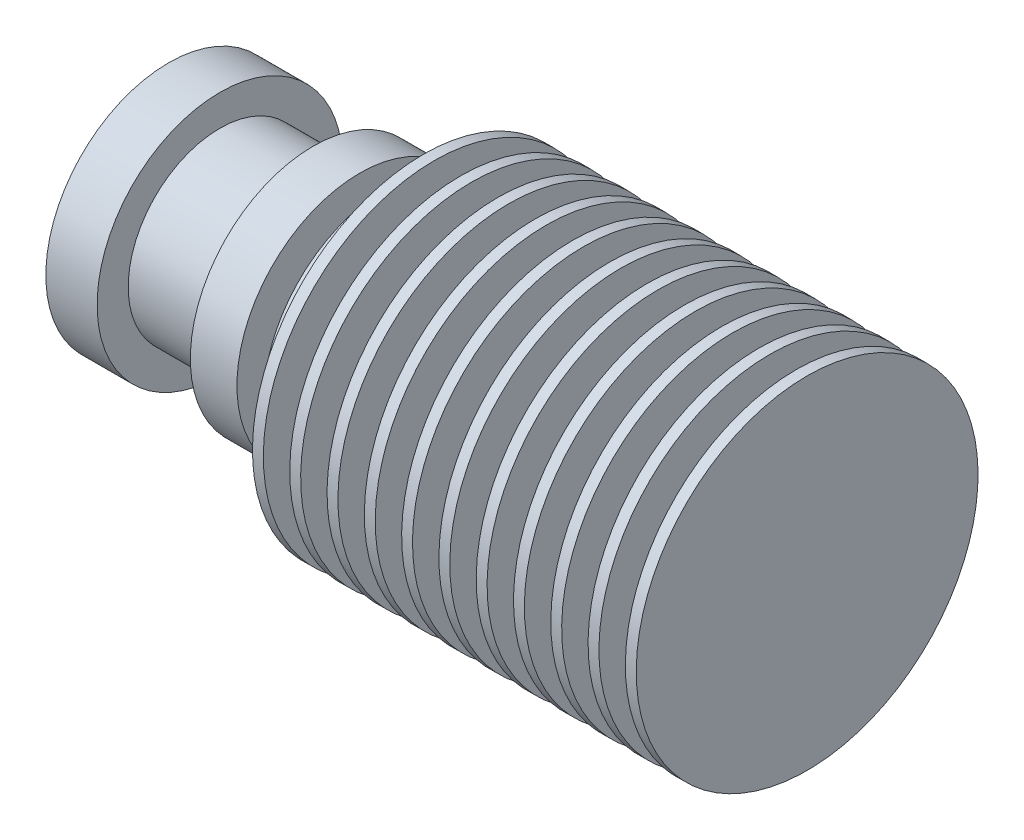
ISO-10303-21;
HEADER;
FILE_DESCRIPTION(('STEP AP214'),'2;1');
FILE_NAME('part.step','',(''),(''),'','','');
FILE_SCHEMA(('AUTOMOTIVE_DESIGN { 1 0 10303 214 1 1 1 1 }'));
ENDSEC;
DATA;
#1=APPLICATION_CONTEXT('core data for automotive mechanical design processes');
#2=APPLICATION_PROTOCOL_DEFINITION('international standard','automotive_design',2000,#1);
#3=PRODUCT_CONTEXT('',#1,'mechanical');
#4=PRODUCT('Part','Part','',(#3));
#5=PRODUCT_RELATED_PRODUCT_CATEGORY('part','',(#4));
#6=PRODUCT_DEFINITION_FORMATION('','',#4);
#7=PRODUCT_DEFINITION_CONTEXT('part definition',#1,'design');
#8=PRODUCT_DEFINITION('design','',#6,#7);
#9=PRODUCT_DEFINITION_SHAPE('','',#8);
#10=(LENGTH_UNIT() NAMED_UNIT(*) SI_UNIT(.MILLI.,.METRE.));
#11=(NAMED_UNIT(*) PLANE_ANGLE_UNIT() SI_UNIT($,.RADIAN.));
#12=(NAMED_UNIT(*) SI_UNIT($,.STERADIAN.) SOLID_ANGLE_UNIT());
#13=UNCERTAINTY_MEASURE_WITH_UNIT(LENGTH_MEASURE(1.E-05),#10,'distance_accuracy_value','');
#14=(GEOMETRIC_REPRESENTATION_CONTEXT(3) GLOBAL_UNCERTAINTY_ASSIGNED_CONTEXT((#13)) GLOBAL_UNIT_ASSIGNED_CONTEXT((#10,
#11,#12)) REPRESENTATION_CONTEXT('',''));
#15=CARTESIAN_POINT('',(0.,0.,0.));
#16=DIRECTION('',(0.,0.,1.));
#17=DIRECTION('',(1.,0.,0.));
#18=AXIS2_PLACEMENT_3D('',#15,#16,#17);
#19=CARTESIAN_POINT('',(-27.999975,5.,0.));
#20=DIRECTION('',(1.,0.,0.));
#21=DIRECTION('',(0.,1.,0.));
#22=AXIS2_PLACEMENT_3D('',#19,#20,#21);
#23=PLANE('',#22);
#24=CARTESIAN_POINT('',(-27.999975,5.,0.));
#25=DIRECTION('',(1.,0.,0.));
#26=DIRECTION('',(0.,1.,0.));
#27=AXIS2_PLACEMENT_3D('',#24,#25,#26);
#28=CIRCLE('',#27,11.);
#29=CARTESIAN_POINT('',(-27.999975,16.,0.));
#30=VERTEX_POINT('',#29);
#31=EDGE_CURVE('E10',#30,#30,#28,.T.);
#32=ORIENTED_EDGE('',*,*,#31,.T.);
#33=EDGE_LOOP('',(#32));
#34=FACE_BOUND('',#33,.T.);
#35=ADVANCED_FACE('F30',(#34),#23,.T.);
#36=CARTESIAN_POINT('',(-27.999975,5.,0.));
#37=DIRECTION('',(1.,0.,0.));
#38=DIRECTION('',(0.,1.,0.));
#39=AXIS2_PLACEMENT_3D('',#36,#37,#38);
#40=CYLINDRICAL_SURFACE('',#39,11.);
#41=CARTESIAN_POINT('',(-28.699975,5.,0.));
#42=DIRECTION('',(1.,0.,0.));
#43=DIRECTION('',(0.,1.,0.));
#44=AXIS2_PLACEMENT_3D('',#41,#42,#43);
#45=CIRCLE('',#44,11.);
#46=CARTESIAN_POINT('',(-28.699975,16.,0.));
#47=VERTEX_POINT('',#46);
#48=EDGE_CURVE('E36',#47,#47,#45,.T.);
#49=ORIENTED_EDGE('',*,*,#48,.T.);
#50=EDGE_LOOP('',(#49));
#51=FACE_BOUND('',#50,.T.);
#52=ORIENTED_EDGE('',*,*,#31,.F.);
#53=EDGE_LOOP('',(#52));
#54=FACE_BOUND('',#53,.T.);
#55=ADVANCED_FACE('F212',(#51,#54),#40,.T.);
#56=CARTESIAN_POINT('',(-28.699975,16.,0.));
#57=DIRECTION('',(-1.,0.,0.));
#58=DIRECTION('',(0.,-1.,0.));
#59=AXIS2_PLACEMENT_3D('',#56,#57,#58);
#60=PLANE('',#59);
#61=CARTESIAN_POINT('',(-28.699975,5.,0.));
#62=DIRECTION('',(1.,0.,0.));
#63=DIRECTION('',(0.,1.,0.));
#64=AXIS2_PLACEMENT_3D('',#61,#62,#63);
#65=CIRCLE('',#64,5.);
#66=CARTESIAN_POINT('',(-28.699975,10.,0.));
#67=VERTEX_POINT('',#66);
#68=EDGE_CURVE('E40',#67,#67,#65,.T.);
#69=ORIENTED_EDGE('',*,*,#68,.T.);
#70=EDGE_LOOP('',(#69));
#71=FACE_BOUND('',#70,.T.);
#72=ORIENTED_EDGE('',*,*,#48,.F.);
#73=EDGE_LOOP('',(#72));
#74=FACE_BOUND('',#73,.T.);
#75=ADVANCED_FACE('F216',(#71,#74),#60,.T.);
#76=CARTESIAN_POINT('',(-27.999975,5.,0.));
#77=DIRECTION('',(1.,0.,0.));
#78=DIRECTION('',(0.,1.,0.));
#79=AXIS2_PLACEMENT_3D('',#76,#77,#78);
#80=CYLINDRICAL_SURFACE('',#79,5.);
#81=CARTESIAN_POINT('',(-30.399975,5.,0.));
#82=DIRECTION('',(1.,0.,0.));
#83=DIRECTION('',(0.,1.,0.));
#84=AXIS2_PLACEMENT_3D('',#81,#82,#83);
#85=CIRCLE('',#84,5.);
#86=CARTESIAN_POINT('',(-30.399975,10.,0.));
#87=VERTEX_POINT('',#86);
#88=EDGE_CURVE('E44',#87,#87,#85,.T.);
#89=ORIENTED_EDGE('',*,*,#88,.T.);
#90=EDGE_LOOP('',(#89));
#91=FACE_BOUND('',#90,.T.);
#92=ORIENTED_EDGE('',*,*,#68,.F.);
#93=EDGE_LOOP('',(#92));
#94=FACE_BOUND('',#93,.T.);
#95=ADVANCED_FACE('F220',(#91,#94),#80,.T.);
#96=CARTESIAN_POINT('',(-30.399975,10.,0.));
#97=DIRECTION('',(1.,0.,0.));
#98=DIRECTION('',(0.,1.,0.));
#99=AXIS2_PLACEMENT_3D('',#96,#97,#98);
#100=PLANE('',#99);
#101=CARTESIAN_POINT('',(-30.399975,5.,0.));
#102=DIRECTION('',(1.,0.,0.));
#103=DIRECTION('',(0.,1.,0.));
#104=AXIS2_PLACEMENT_3D('',#101,#102,#103);
#105=CIRCLE('',#104,11.);
#106=CARTESIAN_POINT('',(-30.399975,16.,0.));
#107=VERTEX_POINT('',#106);
#108=EDGE_CURVE('E49',#107,#107,#105,.T.);
#109=ORIENTED_EDGE('',*,*,#108,.T.);
#110=EDGE_LOOP('',(#109));
#111=FACE_BOUND('',#110,.T.);
#112=ORIENTED_EDGE('',*,*,#88,.F.);
#113=EDGE_LOOP('',(#112));
#114=FACE_BOUND('',#113,.T.);
#115=ADVANCED_FACE('F227',(#111,#114),#100,.T.);
#116=CARTESIAN_POINT('',(-27.999975,5.,0.));
#117=DIRECTION('',(1.,0.,0.));
#118=DIRECTION('',(0.,1.,0.));
#119=AXIS2_PLACEMENT_3D('',#116,#117,#118);
#120=CYLINDRICAL_SURFACE('',#119,11.);
#121=CARTESIAN_POINT('',(-31.099975,5.,0.));
#122=DIRECTION('',(1.,0.,0.));
#123=DIRECTION('',(0.,1.,0.));
#124=AXIS2_PLACEMENT_3D('',#121,#122,#123);
#125=CIRCLE('',#124,11.);
#126=CARTESIAN_POINT('',(-31.099975,16.,0.));
#127=VERTEX_POINT('',#126);
#128=EDGE_CURVE('E52',#127,#127,#125,.T.);
#129=ORIENTED_EDGE('',*,*,#128,.T.);
#130=EDGE_LOOP('',(#129));
#131=FACE_BOUND('',#130,.T.);
#132=ORIENTED_EDGE('',*,*,#108,.F.);
#133=EDGE_LOOP('',(#132));
#134=FACE_BOUND('',#133,.T.);
#135=ADVANCED_FACE('F231',(#131,#134),#120,.T.);
#136=CARTESIAN_POINT('',(-31.099975,16.,0.));
#137=DIRECTION('',(-1.,0.,0.));
#138=DIRECTION('',(0.,-1.,0.));
#139=AXIS2_PLACEMENT_3D('',#136,#137,#138);
#140=PLANE('',#139);
#141=CARTESIAN_POINT('',(-31.099975,5.,0.));
#142=DIRECTION('',(1.,0.,0.));
#143=DIRECTION('',(0.,1.,0.));
#144=AXIS2_PLACEMENT_3D('',#141,#142,#143);
#145=CIRCLE('',#144,4.99999999999998);
#146=CARTESIAN_POINT('',(-31.099975,9.99999999999998,0.));
#147=VERTEX_POINT('',#146);
#148=EDGE_CURVE('E55',#147,#147,#145,.T.);
#149=ORIENTED_EDGE('',*,*,#148,.T.);
#150=EDGE_LOOP('',(#149));
#151=FACE_BOUND('',#150,.T.);
#152=ORIENTED_EDGE('',*,*,#128,.F.);
#153=EDGE_LOOP('',(#152));
#154=FACE_BOUND('',#153,.T.);
#155=ADVANCED_FACE('F235',(#151,#154),#140,.T.);
#156=CARTESIAN_POINT('',(-27.999975,5.,0.));
#157=DIRECTION('',(1.,0.,0.));
#158=DIRECTION('',(0.,1.,0.));
#159=AXIS2_PLACEMENT_3D('',#156,#157,#158);
#160=CYLINDRICAL_SURFACE('',#159,4.99999999999998);
#161=CARTESIAN_POINT('',(-32.799975,5.,0.));
#162=DIRECTION('',(1.,0.,0.));
#163=DIRECTION('',(0.,1.,0.));
#164=AXIS2_PLACEMENT_3D('',#161,#162,#163);
#165=CIRCLE('',#164,4.99999999999999);
#166=CARTESIAN_POINT('',(-32.799975,9.99999999999998,0.));
#167=VERTEX_POINT('',#166);
#168=EDGE_CURVE('E58',#167,#167,#165,.T.);
#169=ORIENTED_EDGE('',*,*,#168,.T.);
#170=EDGE_LOOP('',(#169));
#171=FACE_BOUND('',#170,.T.);
#172=ORIENTED_EDGE('',*,*,#148,.F.);
#173=EDGE_LOOP('',(#172));
#174=FACE_BOUND('',#173,.T.);
#175=ADVANCED_FACE('F239',(#171,#174),#160,.T.);
#176=CARTESIAN_POINT('',(-32.799975,9.99999999999998,0.));
#177=DIRECTION('',(1.,0.,0.));
#178=DIRECTION('',(0.,1.,0.));
#179=AXIS2_PLACEMENT_3D('',#176,#177,#178);
#180=PLANE('',#179);
#181=CARTESIAN_POINT('',(-32.799975,5.,0.));
#182=DIRECTION('',(1.,0.,0.));
#183=DIRECTION('',(0.,1.,0.));
#184=AXIS2_PLACEMENT_3D('',#181,#182,#183);
#185=CIRCLE('',#184,11.);
#186=CARTESIAN_POINT('',(-32.799975,16.,0.));
#187=VERTEX_POINT('',#186);
#188=EDGE_CURVE('E61',#187,#187,#185,.T.);
#189=ORIENTED_EDGE('',*,*,#188,.T.);
#190=EDGE_LOOP('',(#189));
#191=FACE_BOUND('',#190,.T.);
#192=ORIENTED_EDGE('',*,*,#168,.F.);
#193=EDGE_LOOP('',(#192));
#194=FACE_BOUND('',#193,.T.);
#195=ADVANCED_FACE('F243',(#191,#194),#180,.T.);
#196=CARTESIAN_POINT('',(-27.999975,5.,0.));
#197=DIRECTION('',(1.,0.,0.));
#198=DIRECTION('',(0.,1.,0.));
#199=AXIS2_PLACEMENT_3D('',#196,#197,#198);
#200=CYLINDRICAL_SURFACE('',#199,11.);
#201=CARTESIAN_POINT('',(-33.499975,5.,0.));
#202=DIRECTION('',(1.,0.,0.));
#203=DIRECTION('',(0.,1.,0.));
#204=AXIS2_PLACEMENT_3D('',#201,#202,#203);
#205=CIRCLE('',#204,11.);
#206=CARTESIAN_POINT('',(-33.499975,16.,0.));
#207=VERTEX_POINT('',#206);
#208=EDGE_CURVE('E64',#207,#207,#205,.T.);
#209=ORIENTED_EDGE('',*,*,#208,.T.);
#210=EDGE_LOOP('',(#209));
#211=FACE_BOUND('',#210,.T.);
#212=ORIENTED_EDGE('',*,*,#188,.F.);
#213=EDGE_LOOP('',(#212));
#214=FACE_BOUND('',#213,.T.);
#215=ADVANCED_FACE('F247',(#211,#214),#200,.T.);
#216=CARTESIAN_POINT('',(-33.499975,16.,0.));
#217=DIRECTION('',(-1.,0.,0.));
#218=DIRECTION('',(0.,-1.,0.));
#219=AXIS2_PLACEMENT_3D('',#216,#217,#218);
#220=PLANE('',#219);
#221=CARTESIAN_POINT('',(-33.499975,5.,0.));
#222=DIRECTION('',(1.,0.,0.));
#223=DIRECTION('',(0.,1.,0.));
#224=AXIS2_PLACEMENT_3D('',#221,#222,#223);
#225=CIRCLE('',#224,4.99999999999997);
#226=CARTESIAN_POINT('',(-33.499975,9.99999999999997,0.));
#227=VERTEX_POINT('',#226);
#228=EDGE_CURVE('E67',#227,#227,#225,.T.);
#229=ORIENTED_EDGE('',*,*,#228,.T.);
#230=EDGE_LOOP('',(#229));
#231=FACE_BOUND('',#230,.T.);
#232=ORIENTED_EDGE('',*,*,#208,.F.);
#233=EDGE_LOOP('',(#232));
#234=FACE_BOUND('',#233,.T.);
#235=ADVANCED_FACE('F251',(#231,#234),#220,.T.);
#236=CARTESIAN_POINT('',(-27.999975,5.,0.));
#237=DIRECTION('',(1.,0.,0.));
#238=DIRECTION('',(0.,1.,0.));
#239=AXIS2_PLACEMENT_3D('',#236,#237,#238);
#240=CYLINDRICAL_SURFACE('',#239,4.99999999999997);
#241=CARTESIAN_POINT('',(-35.199975,5.,0.));
#242=DIRECTION('',(1.,0.,0.));
#243=DIRECTION('',(0.,1.,0.));
#244=AXIS2_PLACEMENT_3D('',#241,#242,#243);
#245=CIRCLE('',#244,4.99999999999997);
#246=CARTESIAN_POINT('',(-35.199975,9.99999999999997,0.));
#247=VERTEX_POINT('',#246);
#248=EDGE_CURVE('E70',#247,#247,#245,.T.);
#249=ORIENTED_EDGE('',*,*,#248,.T.);
#250=EDGE_LOOP('',(#249));
#251=FACE_BOUND('',#250,.T.);
#252=ORIENTED_EDGE('',*,*,#228,.F.);
#253=EDGE_LOOP('',(#252));
#254=FACE_BOUND('',#253,.T.);
#255=ADVANCED_FACE('F255',(#251,#254),#240,.T.);
#256=CARTESIAN_POINT('',(-35.199975,9.99999999999997,0.));
#257=DIRECTION('',(1.,0.,0.));
#258=DIRECTION('',(0.,1.,0.));
#259=AXIS2_PLACEMENT_3D('',#256,#257,#258);
#260=PLANE('',#259);
#261=CARTESIAN_POINT('',(-35.199975,5.,0.));
#262=DIRECTION('',(1.,0.,0.));
#263=DIRECTION('',(0.,1.,0.));
#264=AXIS2_PLACEMENT_3D('',#261,#262,#263);
#265=CIRCLE('',#264,11.);
#266=CARTESIAN_POINT('',(-35.199975,16.,0.));
#267=VERTEX_POINT('',#266);
#268=EDGE_CURVE('E73',#267,#267,#265,.T.);
#269=ORIENTED_EDGE('',*,*,#268,.T.);
#270=EDGE_LOOP('',(#269));
#271=FACE_BOUND('',#270,.T.);
#272=ORIENTED_EDGE('',*,*,#248,.F.);
#273=EDGE_LOOP('',(#272));
#274=FACE_BOUND('',#273,.T.);
#275=ADVANCED_FACE('F259',(#271,#274),#260,.T.);
#276=CARTESIAN_POINT('',(-27.999975,5.,0.));
#277=DIRECTION('',(1.,0.,0.));
#278=DIRECTION('',(0.,1.,0.));
#279=AXIS2_PLACEMENT_3D('',#276,#277,#278);
#280=CYLINDRICAL_SURFACE('',#279,11.);
#281=CARTESIAN_POINT('',(-35.899975,5.,0.));
#282=DIRECTION('',(1.,0.,0.));
#283=DIRECTION('',(0.,1.,0.));
#284=AXIS2_PLACEMENT_3D('',#281,#282,#283);
#285=CIRCLE('',#284,11.);
#286=CARTESIAN_POINT('',(-35.899975,16.,0.));
#287=VERTEX_POINT('',#286);
#288=EDGE_CURVE('E76',#287,#287,#285,.T.);
#289=ORIENTED_EDGE('',*,*,#288,.T.);
#290=EDGE_LOOP('',(#289));
#291=FACE_BOUND('',#290,.T.);
#292=ORIENTED_EDGE('',*,*,#268,.F.);
#293=EDGE_LOOP('',(#292));
#294=FACE_BOUND('',#293,.T.);
#295=ADVANCED_FACE('F263',(#291,#294),#280,.T.);
#296=CARTESIAN_POINT('',(-35.899975,16.,0.));
#297=DIRECTION('',(-1.,0.,0.));
#298=DIRECTION('',(0.,-1.,0.));
#299=AXIS2_PLACEMENT_3D('',#296,#297,#298);
#300=PLANE('',#299);
#301=CARTESIAN_POINT('',(-35.899975,5.,0.));
#302=DIRECTION('',(1.,0.,0.));
#303=DIRECTION('',(0.,1.,0.));
#304=AXIS2_PLACEMENT_3D('',#301,#302,#303);
#305=CIRCLE('',#304,4.99999999999995);
#306=CARTESIAN_POINT('',(-35.899975,9.99999999999995,0.));
#307=VERTEX_POINT('',#306);
#308=EDGE_CURVE('E79',#307,#307,#305,.T.);
#309=ORIENTED_EDGE('',*,*,#308,.T.);
#310=EDGE_LOOP('',(#309));
#311=FACE_BOUND('',#310,.T.);
#312=ORIENTED_EDGE('',*,*,#288,.F.);
#313=EDGE_LOOP('',(#312));
#314=FACE_BOUND('',#313,.T.);
#315=ADVANCED_FACE('F267',(#311,#314),#300,.T.);
#316=CARTESIAN_POINT('',(-27.999975,5.,0.));
#317=DIRECTION('',(1.,0.,0.));
#318=DIRECTION('',(0.,1.,0.));
#319=AXIS2_PLACEMENT_3D('',#316,#317,#318);
#320=CYLINDRICAL_SURFACE('',#319,4.99999999999995);
#321=CARTESIAN_POINT('',(-37.599975,5.,0.));
#322=DIRECTION('',(1.,0.,0.));
#323=DIRECTION('',(0.,1.,0.));
#324=AXIS2_PLACEMENT_3D('',#321,#322,#323);
#325=CIRCLE('',#324,4.99999999999995);
#326=CARTESIAN_POINT('',(-37.599975,9.99999999999995,0.));
#327=VERTEX_POINT('',#326);
#328=EDGE_CURVE('E82',#327,#327,#325,.T.);
#329=ORIENTED_EDGE('',*,*,#328,.T.);
#330=EDGE_LOOP('',(#329));
#331=FACE_BOUND('',#330,.T.);
#332=ORIENTED_EDGE('',*,*,#308,.F.);
#333=EDGE_LOOP('',(#332));
#334=FACE_BOUND('',#333,.T.);
#335=ADVANCED_FACE('F271',(#331,#334),#320,.T.);
#336=CARTESIAN_POINT('',(-37.599975,9.99999999999995,0.));
#337=DIRECTION('',(1.,0.,0.));
#338=DIRECTION('',(0.,1.,0.));
#339=AXIS2_PLACEMENT_3D('',#336,#337,#338);
#340=PLANE('',#339);
#341=CARTESIAN_POINT('',(-37.599975,5.,0.));
#342=DIRECTION('',(1.,0.,0.));
#343=DIRECTION('',(0.,1.,0.));
#344=AXIS2_PLACEMENT_3D('',#341,#342,#343);
#345=CIRCLE('',#344,10.9999999999999);
#346=CARTESIAN_POINT('',(-37.599975,15.9999999999999,0.));
#347=VERTEX_POINT('',#346);
#348=EDGE_CURVE('E85',#347,#347,#345,.T.);
#349=ORIENTED_EDGE('',*,*,#348,.T.);
#350=EDGE_LOOP('',(#349));
#351=FACE_BOUND('',#350,.T.);
#352=ORIENTED_EDGE('',*,*,#328,.F.);
#353=EDGE_LOOP('',(#352));
#354=FACE_BOUND('',#353,.T.);
#355=ADVANCED_FACE('F275',(#351,#354),#340,.T.);
#356=CARTESIAN_POINT('',(-27.999975,5.,0.));
#357=DIRECTION('',(1.,0.,0.));
#358=DIRECTION('',(0.,1.,0.));
#359=AXIS2_PLACEMENT_3D('',#356,#357,#358);
#360=CYLINDRICAL_SURFACE('',#359,10.9999999999999);
#361=CARTESIAN_POINT('',(-38.299975,5.,0.));
#362=DIRECTION('',(1.,0.,0.));
#363=DIRECTION('',(0.,1.,0.));
#364=AXIS2_PLACEMENT_3D('',#361,#362,#363);
#365=CIRCLE('',#364,10.9999999999999);
#366=CARTESIAN_POINT('',(-38.299975,15.9999999999999,0.));
#367=VERTEX_POINT('',#366);
#368=EDGE_CURVE('E88',#367,#367,#365,.T.);
#369=ORIENTED_EDGE('',*,*,#368,.T.);
#370=EDGE_LOOP('',(#369));
#371=FACE_BOUND('',#370,.T.);
#372=ORIENTED_EDGE('',*,*,#348,.F.);
#373=EDGE_LOOP('',(#372));
#374=FACE_BOUND('',#373,.T.);
#375=ADVANCED_FACE('F279',(#371,#374),#360,.T.);
#376=CARTESIAN_POINT('',(-38.299975,15.9999999999999,0.));
#377=DIRECTION('',(-1.,0.,0.));
#378=DIRECTION('',(0.,-1.,0.));
#379=AXIS2_PLACEMENT_3D('',#376,#377,#378);
#380=PLANE('',#379);
#381=CARTESIAN_POINT('',(-38.299975,5.,0.));
#382=DIRECTION('',(1.,0.,0.));
#383=DIRECTION('',(0.,1.,0.));
#384=AXIS2_PLACEMENT_3D('',#381,#382,#383);
#385=CIRCLE('',#384,4.99999999999993);
#386=CARTESIAN_POINT('',(-38.299975,9.99999999999993,0.));
#387=VERTEX_POINT('',#386);
#388=EDGE_CURVE('E91',#387,#387,#385,.T.);
#389=ORIENTED_EDGE('',*,*,#388,.T.);
#390=EDGE_LOOP('',(#389));
#391=FACE_BOUND('',#390,.T.);
#392=ORIENTED_EDGE('',*,*,#368,.F.);
#393=EDGE_LOOP('',(#392));
#394=FACE_BOUND('',#393,.T.);
#395=ADVANCED_FACE('F283',(#391,#394),#380,.T.);
#396=CARTESIAN_POINT('',(-27.999975,5.,0.));
#397=DIRECTION('',(1.,0.,0.));
#398=DIRECTION('',(0.,1.,0.));
#399=AXIS2_PLACEMENT_3D('',#396,#397,#398);
#400=CYLINDRICAL_SURFACE('',#399,4.99999999999994);
#401=CARTESIAN_POINT('',(-39.999975,5.,0.));
#402=DIRECTION('',(1.,0.,0.));
#403=DIRECTION('',(0.,1.,0.));
#404=AXIS2_PLACEMENT_3D('',#401,#402,#403);
#405=CIRCLE('',#404,4.99999999999994);
#406=CARTESIAN_POINT('',(-39.999975,9.99999999999993,0.));
#407=VERTEX_POINT('',#406);
#408=EDGE_CURVE('E94',#407,#407,#405,.T.);
#409=ORIENTED_EDGE('',*,*,#408,.T.);
#410=EDGE_LOOP('',(#409));
#411=FACE_BOUND('',#410,.T.);
#412=ORIENTED_EDGE('',*,*,#388,.F.);
#413=EDGE_LOOP('',(#412));
#414=FACE_BOUND('',#413,.T.);
#415=ADVANCED_FACE('F287',(#411,#414),#400,.T.);
#416=CARTESIAN_POINT('',(-39.999975,9.99999999999993,0.));
#417=DIRECTION('',(1.,0.,0.));
#418=DIRECTION('',(0.,1.,0.));
#419=AXIS2_PLACEMENT_3D('',#416,#417,#418);
#420=PLANE('',#419);
#421=CARTESIAN_POINT('',(-39.999975,5.,0.));
#422=DIRECTION('',(1.,0.,0.));
#423=DIRECTION('',(0.,1.,0.));
#424=AXIS2_PLACEMENT_3D('',#421,#422,#423);
#425=CIRCLE('',#424,10.9999999999999);
#426=CARTESIAN_POINT('',(-39.999975,15.9999999999999,0.));
#427=VERTEX_POINT('',#426);
#428=EDGE_CURVE('E97',#427,#427,#425,.T.);
#429=ORIENTED_EDGE('',*,*,#428,.T.);
#430=EDGE_LOOP('',(#429));
#431=FACE_BOUND('',#430,.T.);
#432=ORIENTED_EDGE('',*,*,#408,.F.);
#433=EDGE_LOOP('',(#432));
#434=FACE_BOUND('',#433,.T.);
#435=ADVANCED_FACE('F291',(#431,#434),#420,.T.);
#436=CARTESIAN_POINT('',(-27.999975,5.,0.));
#437=DIRECTION('',(1.,0.,0.));
#438=DIRECTION('',(0.,1.,0.));
#439=AXIS2_PLACEMENT_3D('',#436,#437,#438);
#440=CYLINDRICAL_SURFACE('',#439,10.9999999999999);
#441=CARTESIAN_POINT('',(-40.699975,5.,0.));
#442=DIRECTION('',(1.,0.,0.));
#443=DIRECTION('',(0.,1.,0.));
#444=AXIS2_PLACEMENT_3D('',#441,#442,#443);
#445=CIRCLE('',#444,10.9999999999999);
#446=CARTESIAN_POINT('',(-40.699975,15.9999999999999,0.));
#447=VERTEX_POINT('',#446);
#448=EDGE_CURVE('E100',#447,#447,#445,.T.);
#449=ORIENTED_EDGE('',*,*,#448,.T.);
#450=EDGE_LOOP('',(#449));
#451=FACE_BOUND('',#450,.T.);
#452=ORIENTED_EDGE('',*,*,#428,.F.);
#453=EDGE_LOOP('',(#452));
#454=FACE_BOUND('',#453,.T.);
#455=ADVANCED_FACE('F295',(#451,#454),#440,.T.);
#456=CARTESIAN_POINT('',(-40.699975,15.9999999999999,0.));
#457=DIRECTION('',(-1.,0.,0.));
#458=DIRECTION('',(0.,-1.,0.));
#459=AXIS2_PLACEMENT_3D('',#456,#457,#458);
#460=PLANE('',#459);
#461=CARTESIAN_POINT('',(-40.699975,5.,0.));
#462=DIRECTION('',(1.,0.,0.));
#463=DIRECTION('',(0.,1.,0.));
#464=AXIS2_PLACEMENT_3D('',#461,#462,#463);
#465=CIRCLE('',#464,4.99999999999992);
#466=CARTESIAN_POINT('',(-40.699975,9.99999999999992,0.));
#467=VERTEX_POINT('',#466);
#468=EDGE_CURVE('E103',#467,#467,#465,.T.);
#469=ORIENTED_EDGE('',*,*,#468,.T.);
#470=EDGE_LOOP('',(#469));
#471=FACE_BOUND('',#470,.T.);
#472=ORIENTED_EDGE('',*,*,#448,.F.);
#473=EDGE_LOOP('',(#472));
#474=FACE_BOUND('',#473,.T.);
#475=ADVANCED_FACE('F299',(#471,#474),#460,.T.);
#476=CARTESIAN_POINT('',(-27.999975,5.,0.));
#477=DIRECTION('',(1.,0.,0.));
#478=DIRECTION('',(0.,1.,0.));
#479=AXIS2_PLACEMENT_3D('',#476,#477,#478);
#480=CYLINDRICAL_SURFACE('',#479,4.99999999999992);
#481=CARTESIAN_POINT('',(-42.399975,5.,0.));
#482=DIRECTION('',(1.,0.,0.));
#483=DIRECTION('',(0.,1.,0.));
#484=AXIS2_PLACEMENT_3D('',#481,#482,#483);
#485=CIRCLE('',#484,4.99999999999992);
#486=CARTESIAN_POINT('',(-42.399975,9.99999999999992,0.));
#487=VERTEX_POINT('',#486);
#488=EDGE_CURVE('E106',#487,#487,#485,.T.);
#489=ORIENTED_EDGE('',*,*,#488,.T.);
#490=EDGE_LOOP('',(#489));
#491=FACE_BOUND('',#490,.T.);
#492=ORIENTED_EDGE('',*,*,#468,.F.);
#493=EDGE_LOOP('',(#492));
#494=FACE_BOUND('',#493,.T.);
#495=ADVANCED_FACE('F303',(#491,#494),#480,.T.);
#496=CARTESIAN_POINT('',(-42.399975,9.99999999999992,0.));
#497=DIRECTION('',(1.,0.,0.));
#498=DIRECTION('',(0.,1.,0.));
#499=AXIS2_PLACEMENT_3D('',#496,#497,#498);
#500=PLANE('',#499);
#501=CARTESIAN_POINT('',(-42.399975,5.,0.));
#502=DIRECTION('',(1.,0.,0.));
#503=DIRECTION('',(0.,1.,0.));
#504=AXIS2_PLACEMENT_3D('',#501,#502,#503);
#505=CIRCLE('',#504,10.9999999999999);
#506=CARTESIAN_POINT('',(-42.399975,15.9999999999999,0.));
#507=VERTEX_POINT('',#506);
#508=EDGE_CURVE('E109',#507,#507,#505,.T.);
#509=ORIENTED_EDGE('',*,*,#508,.T.);
#510=EDGE_LOOP('',(#509));
#511=FACE_BOUND('',#510,.T.);
#512=ORIENTED_EDGE('',*,*,#488,.F.);
#513=EDGE_LOOP('',(#512));
#514=FACE_BOUND('',#513,.T.);
#515=ADVANCED_FACE('F307',(#511,#514),#500,.T.);
#516=CARTESIAN_POINT('',(-27.999975,5.,0.));
#517=DIRECTION('',(1.,0.,0.));
#518=DIRECTION('',(0.,1.,0.));
#519=AXIS2_PLACEMENT_3D('',#516,#517,#518);
#520=CYLINDRICAL_SURFACE('',#519,10.9999999999999);
#521=CARTESIAN_POINT('',(-43.099975,5.,0.));
#522=DIRECTION('',(1.,0.,0.));
#523=DIRECTION('',(0.,1.,0.));
#524=AXIS2_PLACEMENT_3D('',#521,#522,#523);
#525=CIRCLE('',#524,10.9999999999999);
#526=CARTESIAN_POINT('',(-43.099975,15.9999999999999,0.));
#527=VERTEX_POINT('',#526);
#528=EDGE_CURVE('E112',#527,#527,#525,.T.);
#529=ORIENTED_EDGE('',*,*,#528,.T.);
#530=EDGE_LOOP('',(#529));
#531=FACE_BOUND('',#530,.T.);
#532=ORIENTED_EDGE('',*,*,#508,.F.);
#533=EDGE_LOOP('',(#532));
#534=FACE_BOUND('',#533,.T.);
#535=ADVANCED_FACE('F311',(#531,#534),#520,.T.);
#536=CARTESIAN_POINT('',(-43.099975,15.9999999999999,0.));
#537=DIRECTION('',(-1.,0.,0.));
#538=DIRECTION('',(0.,-1.,0.));
#539=AXIS2_PLACEMENT_3D('',#536,#537,#538);
#540=PLANE('',#539);
#541=CARTESIAN_POINT('',(-43.099975,5.,0.));
#542=DIRECTION('',(1.,0.,0.));
#543=DIRECTION('',(0.,1.,0.));
#544=AXIS2_PLACEMENT_3D('',#541,#542,#543);
#545=CIRCLE('',#544,4.9999999999999);
#546=CARTESIAN_POINT('',(-43.099975,9.9999999999999,0.));
#547=VERTEX_POINT('',#546);
#548=EDGE_CURVE('E115',#547,#547,#545,.T.);
#549=ORIENTED_EDGE('',*,*,#548,.T.);
#550=EDGE_LOOP('',(#549));
#551=FACE_BOUND('',#550,.T.);
#552=ORIENTED_EDGE('',*,*,#528,.F.);
#553=EDGE_LOOP('',(#552));
#554=FACE_BOUND('',#553,.T.);
#555=ADVANCED_FACE('F315',(#551,#554),#540,.T.);
#556=CARTESIAN_POINT('',(-27.999975,5.,0.));
#557=DIRECTION('',(1.,0.,0.));
#558=DIRECTION('',(0.,1.,0.));
#559=AXIS2_PLACEMENT_3D('',#556,#557,#558);
#560=CYLINDRICAL_SURFACE('',#559,4.9999999999999);
#561=CARTESIAN_POINT('',(-44.799975,5.,0.));
#562=DIRECTION('',(1.,0.,0.));
#563=DIRECTION('',(0.,1.,0.));
#564=AXIS2_PLACEMENT_3D('',#561,#562,#563);
#565=CIRCLE('',#564,4.9999999999999);
#566=CARTESIAN_POINT('',(-44.799975,9.9999999999999,0.));
#567=VERTEX_POINT('',#566);
#568=EDGE_CURVE('E118',#567,#567,#565,.T.);
#569=ORIENTED_EDGE('',*,*,#568,.T.);
#570=EDGE_LOOP('',(#569));
#571=FACE_BOUND('',#570,.T.);
#572=ORIENTED_EDGE('',*,*,#548,.F.);
#573=EDGE_LOOP('',(#572));
#574=FACE_BOUND('',#573,.T.);
#575=ADVANCED_FACE('F319',(#571,#574),#560,.T.);
#576=CARTESIAN_POINT('',(-44.799975,9.9999999999999,0.));
#577=DIRECTION('',(1.,0.,0.));
#578=DIRECTION('',(0.,1.,0.));
#579=AXIS2_PLACEMENT_3D('',#576,#577,#578);
#580=PLANE('',#579);
#581=CARTESIAN_POINT('',(-44.799975,5.,0.));
#582=DIRECTION('',(1.,0.,0.));
#583=DIRECTION('',(0.,1.,0.));
#584=AXIS2_PLACEMENT_3D('',#581,#582,#583);
#585=CIRCLE('',#584,10.9999999999999);
#586=CARTESIAN_POINT('',(-44.799975,15.9999999999999,0.));
#587=VERTEX_POINT('',#586);
#588=EDGE_CURVE('E121',#587,#587,#585,.T.);
#589=ORIENTED_EDGE('',*,*,#588,.T.);
#590=EDGE_LOOP('',(#589));
#591=FACE_BOUND('',#590,.T.);
#592=ORIENTED_EDGE('',*,*,#568,.F.);
#593=EDGE_LOOP('',(#592));
#594=FACE_BOUND('',#593,.T.);
#595=ADVANCED_FACE('F323',(#591,#594),#580,.T.);
#596=CARTESIAN_POINT('',(-27.999975,5.,0.));
#597=DIRECTION('',(1.,0.,0.));
#598=DIRECTION('',(0.,1.,0.));
#599=AXIS2_PLACEMENT_3D('',#596,#597,#598);
#600=CYLINDRICAL_SURFACE('',#599,10.9999999999999);
#601=CARTESIAN_POINT('',(-45.499975,5.,0.));
#602=DIRECTION('',(1.,0.,0.));
#603=DIRECTION('',(0.,1.,0.));
#604=AXIS2_PLACEMENT_3D('',#601,#602,#603);
#605=CIRCLE('',#604,10.9999999999999);
#606=CARTESIAN_POINT('',(-45.499975,15.9999999999999,0.));
#607=VERTEX_POINT('',#606);
#608=EDGE_CURVE('E124',#607,#607,#605,.T.);
#609=ORIENTED_EDGE('',*,*,#608,.T.);
#610=EDGE_LOOP('',(#609));
#611=FACE_BOUND('',#610,.T.);
#612=ORIENTED_EDGE('',*,*,#588,.F.);
#613=EDGE_LOOP('',(#612));
#614=FACE_BOUND('',#613,.T.);
#615=ADVANCED_FACE('F327',(#611,#614),#600,.T.);
#616=CARTESIAN_POINT('',(-45.499975,15.9999999999999,0.));
#617=DIRECTION('',(-1.,0.,0.));
#618=DIRECTION('',(0.,-1.,0.));
#619=AXIS2_PLACEMENT_3D('',#616,#617,#618);
#620=PLANE('',#619);
#621=CARTESIAN_POINT('',(-45.499975,5.,0.));
#622=DIRECTION('',(1.,0.,0.));
#623=DIRECTION('',(0.,1.,0.));
#624=AXIS2_PLACEMENT_3D('',#621,#622,#623);
#625=CIRCLE('',#624,4.99999999999988);
#626=CARTESIAN_POINT('',(-45.499975,9.99999999999988,0.));
#627=VERTEX_POINT('',#626);
#628=EDGE_CURVE('E127',#627,#627,#625,.T.);
#629=ORIENTED_EDGE('',*,*,#628,.T.);
#630=EDGE_LOOP('',(#629));
#631=FACE_BOUND('',#630,.T.);
#632=ORIENTED_EDGE('',*,*,#608,.F.);
#633=EDGE_LOOP('',(#632));
#634=FACE_BOUND('',#633,.T.);
#635=ADVANCED_FACE('F331',(#631,#634),#620,.T.);
#636=CARTESIAN_POINT('',(-27.999975,5.,0.));
#637=DIRECTION('',(1.,0.,0.));
#638=DIRECTION('',(0.,1.,0.));
#639=AXIS2_PLACEMENT_3D('',#636,#637,#638);
#640=CYLINDRICAL_SURFACE('',#639,4.99999999999989);
#641=CARTESIAN_POINT('',(-47.199975,5.,0.));
#642=DIRECTION('',(1.,0.,0.));
#643=DIRECTION('',(0.,1.,0.));
#644=AXIS2_PLACEMENT_3D('',#641,#642,#643);
#645=CIRCLE('',#644,4.99999999999989);
#646=CARTESIAN_POINT('',(-47.199975,9.99999999999988,0.));
#647=VERTEX_POINT('',#646);
#648=EDGE_CURVE('E130',#647,#647,#645,.T.);
#649=ORIENTED_EDGE('',*,*,#648,.T.);
#650=EDGE_LOOP('',(#649));
#651=FACE_BOUND('',#650,.T.);
#652=ORIENTED_EDGE('',*,*,#628,.F.);
#653=EDGE_LOOP('',(#652));
#654=FACE_BOUND('',#653,.T.);
#655=ADVANCED_FACE('F335',(#651,#654),#640,.T.);
#656=CARTESIAN_POINT('',(-47.199975,9.99999999999988,0.));
#657=DIRECTION('',(1.,0.,0.));
#658=DIRECTION('',(0.,1.,0.));
#659=AXIS2_PLACEMENT_3D('',#656,#657,#658);
#660=PLANE('',#659);
#661=CARTESIAN_POINT('',(-47.199975,5.,0.));
#662=DIRECTION('',(1.,0.,0.));
#663=DIRECTION('',(0.,1.,0.));
#664=AXIS2_PLACEMENT_3D('',#661,#662,#663);
#665=CIRCLE('',#664,10.9999999999999);
#666=CARTESIAN_POINT('',(-47.199975,15.9999999999999,0.));
#667=VERTEX_POINT('',#666);
#668=EDGE_CURVE('E133',#667,#667,#665,.T.);
#669=ORIENTED_EDGE('',*,*,#668,.T.);
#670=EDGE_LOOP('',(#669));
#671=FACE_BOUND('',#670,.T.);
#672=ORIENTED_EDGE('',*,*,#648,.F.);
#673=EDGE_LOOP('',(#672));
#674=FACE_BOUND('',#673,.T.);
#675=ADVANCED_FACE('F339',(#671,#674),#660,.T.);
#676=CARTESIAN_POINT('',(-27.999975,5.,0.));
#677=DIRECTION('',(1.,0.,0.));
#678=DIRECTION('',(0.,1.,0.));
#679=AXIS2_PLACEMENT_3D('',#676,#677,#678);
#680=CYLINDRICAL_SURFACE('',#679,10.9999999999999);
#681=CARTESIAN_POINT('',(-47.899975,5.,0.));
#682=DIRECTION('',(1.,0.,0.));
#683=DIRECTION('',(0.,1.,0.));
#684=AXIS2_PLACEMENT_3D('',#681,#682,#683);
#685=CIRCLE('',#684,10.9999999999999);
#686=CARTESIAN_POINT('',(-47.899975,15.9999999999999,0.));
#687=VERTEX_POINT('',#686);
#688=EDGE_CURVE('E136',#687,#687,#685,.T.);
#689=ORIENTED_EDGE('',*,*,#688,.T.);
#690=EDGE_LOOP('',(#689));
#691=FACE_BOUND('',#690,.T.);
#692=ORIENTED_EDGE('',*,*,#668,.F.);
#693=EDGE_LOOP('',(#692));
#694=FACE_BOUND('',#693,.T.);
#695=ADVANCED_FACE('F343',(#691,#694),#680,.T.);
#696=CARTESIAN_POINT('',(-47.899975,15.9999999999999,0.));
#697=DIRECTION('',(-1.,0.,0.));
#698=DIRECTION('',(0.,-1.,0.));
#699=AXIS2_PLACEMENT_3D('',#696,#697,#698);
#700=PLANE('',#699);
#701=CARTESIAN_POINT('',(-47.899975,5.,0.));
#702=DIRECTION('',(1.,0.,0.));
#703=DIRECTION('',(0.,1.,0.));
#704=AXIS2_PLACEMENT_3D('',#701,#702,#703);
#705=CIRCLE('',#704,4.99999999999987);
#706=CARTESIAN_POINT('',(-47.899975,9.99999999999987,0.));
#707=VERTEX_POINT('',#706);
#708=EDGE_CURVE('E139',#707,#707,#705,.T.);
#709=ORIENTED_EDGE('',*,*,#708,.T.);
#710=EDGE_LOOP('',(#709));
#711=FACE_BOUND('',#710,.T.);
#712=ORIENTED_EDGE('',*,*,#688,.F.);
#713=EDGE_LOOP('',(#712));
#714=FACE_BOUND('',#713,.T.);
#715=ADVANCED_FACE('F347',(#711,#714),#700,.T.);
#716=CARTESIAN_POINT('',(-27.999975,5.,0.));
#717=DIRECTION('',(1.,0.,0.));
#718=DIRECTION('',(0.,1.,0.));
#719=AXIS2_PLACEMENT_3D('',#716,#717,#718);
#720=CYLINDRICAL_SURFACE('',#719,4.99999999999987);
#721=CARTESIAN_POINT('',(-49.599975,5.,0.));
#722=DIRECTION('',(1.,0.,0.));
#723=DIRECTION('',(0.,1.,0.));
#724=AXIS2_PLACEMENT_3D('',#721,#722,#723);
#725=CIRCLE('',#724,4.99999999999987);
#726=CARTESIAN_POINT('',(-49.599975,9.99999999999987,0.));
#727=VERTEX_POINT('',#726);
#728=EDGE_CURVE('E142',#727,#727,#725,.T.);
#729=ORIENTED_EDGE('',*,*,#728,.T.);
#730=EDGE_LOOP('',(#729));
#731=FACE_BOUND('',#730,.T.);
#732=ORIENTED_EDGE('',*,*,#708,.F.);
#733=EDGE_LOOP('',(#732));
#734=FACE_BOUND('',#733,.T.);
#735=ADVANCED_FACE('F351',(#731,#734),#720,.T.);
#736=CARTESIAN_POINT('',(-49.599975,9.99999999999987,0.));
#737=DIRECTION('',(1.,0.,0.));
#738=DIRECTION('',(0.,1.,0.));
#739=AXIS2_PLACEMENT_3D('',#736,#737,#738);
#740=PLANE('',#739);
#741=CARTESIAN_POINT('',(-49.599975,5.,0.));
#742=DIRECTION('',(1.,0.,0.));
#743=DIRECTION('',(0.,1.,0.));
#744=AXIS2_PLACEMENT_3D('',#741,#742,#743);
#745=CIRCLE('',#744,10.9999999999999);
#746=CARTESIAN_POINT('',(-49.599975,15.9999999999999,0.));
#747=VERTEX_POINT('',#746);
#748=EDGE_CURVE('E145',#747,#747,#745,.T.);
#749=ORIENTED_EDGE('',*,*,#748,.T.);
#750=EDGE_LOOP('',(#749));
#751=FACE_BOUND('',#750,.T.);
#752=ORIENTED_EDGE('',*,*,#728,.F.);
#753=EDGE_LOOP('',(#752));
#754=FACE_BOUND('',#753,.T.);
#755=ADVANCED_FACE('F355',(#751,#754),#740,.T.);
#756=CARTESIAN_POINT('',(-27.999975,5.,0.));
#757=DIRECTION('',(1.,0.,0.));
#758=DIRECTION('',(0.,1.,0.));
#759=AXIS2_PLACEMENT_3D('',#756,#757,#758);
#760=CYLINDRICAL_SURFACE('',#759,10.9999999999999);
#761=CARTESIAN_POINT('',(-50.299975,5.,0.));
#762=DIRECTION('',(1.,0.,0.));
#763=DIRECTION('',(0.,1.,0.));
#764=AXIS2_PLACEMENT_3D('',#761,#762,#763);
#765=CIRCLE('',#764,10.9999999999999);
#766=CARTESIAN_POINT('',(-50.299975,15.9999999999999,0.));
#767=VERTEX_POINT('',#766);
#768=EDGE_CURVE('E148',#767,#767,#765,.T.);
#769=ORIENTED_EDGE('',*,*,#768,.T.);
#770=EDGE_LOOP('',(#769));
#771=FACE_BOUND('',#770,.T.);
#772=ORIENTED_EDGE('',*,*,#748,.F.);
#773=EDGE_LOOP('',(#772));
#774=FACE_BOUND('',#773,.T.);
#775=ADVANCED_FACE('F359',(#771,#774),#760,.T.);
#776=CARTESIAN_POINT('',(-50.299975,15.9999999999999,0.));
#777=DIRECTION('',(-1.,0.,0.));
#778=DIRECTION('',(0.,-1.,0.));
#779=AXIS2_PLACEMENT_3D('',#776,#777,#778);
#780=PLANE('',#779);
#781=CARTESIAN_POINT('',(-50.299975,5.,0.));
#782=DIRECTION('',(1.,0.,0.));
#783=DIRECTION('',(0.,1.,0.));
#784=AXIS2_PLACEMENT_3D('',#781,#782,#783);
#785=CIRCLE('',#784,4.99999999999985);
#786=CARTESIAN_POINT('',(-50.299975,9.99999999999985,0.));
#787=VERTEX_POINT('',#786);
#788=EDGE_CURVE('E151',#787,#787,#785,.T.);
#789=ORIENTED_EDGE('',*,*,#788,.T.);
#790=EDGE_LOOP('',(#789));
#791=FACE_BOUND('',#790,.T.);
#792=ORIENTED_EDGE('',*,*,#768,.F.);
#793=EDGE_LOOP('',(#792));
#794=FACE_BOUND('',#793,.T.);
#795=ADVANCED_FACE('F363',(#791,#794),#780,.T.);
#796=CARTESIAN_POINT('',(-27.999975,5.,0.));
#797=DIRECTION('',(1.,0.,0.));
#798=DIRECTION('',(0.,1.,0.));
#799=AXIS2_PLACEMENT_3D('',#796,#797,#798);
#800=CYLINDRICAL_SURFACE('',#799,4.99999999999985);
#801=CARTESIAN_POINT('',(-51.999975,5.,0.));
#802=DIRECTION('',(1.,0.,0.));
#803=DIRECTION('',(0.,1.,0.));
#804=AXIS2_PLACEMENT_3D('',#801,#802,#803);
#805=CIRCLE('',#804,4.99999999999985);
#806=CARTESIAN_POINT('',(-51.999975,9.99999999999985,0.));
#807=VERTEX_POINT('',#806);
#808=EDGE_CURVE('E154',#807,#807,#805,.T.);
#809=ORIENTED_EDGE('',*,*,#808,.T.);
#810=EDGE_LOOP('',(#809));
#811=FACE_BOUND('',#810,.T.);
#812=ORIENTED_EDGE('',*,*,#788,.F.);
#813=EDGE_LOOP('',(#812));
#814=FACE_BOUND('',#813,.T.);
#815=ADVANCED_FACE('F367',(#811,#814),#800,.T.);
#816=CARTESIAN_POINT('',(-51.999975,9.99999999999985,0.));
#817=DIRECTION('',(1.,0.,0.));
#818=DIRECTION('',(0.,1.,0.));
#819=AXIS2_PLACEMENT_3D('',#816,#817,#818);
#820=PLANE('',#819);
#821=CARTESIAN_POINT('',(-51.999975,5.,0.));
#822=DIRECTION('',(1.,0.,0.));
#823=DIRECTION('',(0.,1.,0.));
#824=AXIS2_PLACEMENT_3D('',#821,#822,#823);
#825=CIRCLE('',#824,10.9999999999998);
#826=CARTESIAN_POINT('',(-51.999975,15.9999999999998,0.));
#827=VERTEX_POINT('',#826);
#828=EDGE_CURVE('E157',#827,#827,#825,.T.);
#829=ORIENTED_EDGE('',*,*,#828,.T.);
#830=EDGE_LOOP('',(#829));
#831=FACE_BOUND('',#830,.T.);
#832=ORIENTED_EDGE('',*,*,#808,.F.);
#833=EDGE_LOOP('',(#832));
#834=FACE_BOUND('',#833,.T.);
#835=ADVANCED_FACE('F371',(#831,#834),#820,.T.);
#836=CARTESIAN_POINT('',(-27.999975,5.,0.));
#837=DIRECTION('',(1.,0.,0.));
#838=DIRECTION('',(0.,1.,0.));
#839=AXIS2_PLACEMENT_3D('',#836,#837,#838);
#840=CYLINDRICAL_SURFACE('',#839,10.9999999999998);
#841=CARTESIAN_POINT('',(-52.699975,5.,0.));
#842=DIRECTION('',(1.,0.,0.));
#843=DIRECTION('',(0.,1.,0.));
#844=AXIS2_PLACEMENT_3D('',#841,#842,#843);
#845=CIRCLE('',#844,10.9999999999998);
#846=CARTESIAN_POINT('',(-52.699975,15.9999999999998,0.));
#847=VERTEX_POINT('',#846);
#848=EDGE_CURVE('E160',#847,#847,#845,.T.);
#849=ORIENTED_EDGE('',*,*,#848,.T.);
#850=EDGE_LOOP('',(#849));
#851=FACE_BOUND('',#850,.T.);
#852=ORIENTED_EDGE('',*,*,#828,.F.);
#853=EDGE_LOOP('',(#852));
#854=FACE_BOUND('',#853,.T.);
#855=ADVANCED_FACE('F375',(#851,#854),#840,.T.);
#856=CARTESIAN_POINT('',(-52.699975,15.9999999999998,0.));
#857=DIRECTION('',(-1.,0.,0.));
#858=DIRECTION('',(0.,-1.,0.));
#859=AXIS2_PLACEMENT_3D('',#856,#857,#858);
#860=PLANE('',#859);
#861=CARTESIAN_POINT('',(-52.699975,5.,0.));
#862=DIRECTION('',(1.,0.,0.));
#863=DIRECTION('',(0.,1.,0.));
#864=AXIS2_PLACEMENT_3D('',#861,#862,#863);
#865=CIRCLE('',#864,4.99999999999984);
#866=CARTESIAN_POINT('',(-52.699975,9.99999999999983,0.));
#867=VERTEX_POINT('',#866);
#868=EDGE_CURVE('E163',#867,#867,#865,.T.);
#869=ORIENTED_EDGE('',*,*,#868,.T.);
#870=EDGE_LOOP('',(#869));
#871=FACE_BOUND('',#870,.T.);
#872=ORIENTED_EDGE('',*,*,#848,.F.);
#873=EDGE_LOOP('',(#872));
#874=FACE_BOUND('',#873,.T.);
#875=ADVANCED_FACE('F379',(#871,#874),#860,.T.);
#876=CARTESIAN_POINT('',(-27.999975,5.,0.));
#877=DIRECTION('',(1.,0.,0.));
#878=DIRECTION('',(0.,1.,0.));
#879=AXIS2_PLACEMENT_3D('',#876,#877,#878);
#880=CYLINDRICAL_SURFACE('',#879,4.99999999999984);
#881=CARTESIAN_POINT('',(-54.399975,5.,0.));
#882=DIRECTION('',(1.,0.,0.));
#883=DIRECTION('',(0.,1.,0.));
#884=AXIS2_PLACEMENT_3D('',#881,#882,#883);
#885=CIRCLE('',#884,4.99999999999984);
#886=CARTESIAN_POINT('',(-54.399975,9.99999999999983,0.));
#887=VERTEX_POINT('',#886);
#888=EDGE_CURVE('E166',#887,#887,#885,.T.);
#889=ORIENTED_EDGE('',*,*,#888,.T.);
#890=EDGE_LOOP('',(#889));
#891=FACE_BOUND('',#890,.T.);
#892=ORIENTED_EDGE('',*,*,#868,.F.);
#893=EDGE_LOOP('',(#892));
#894=FACE_BOUND('',#893,.T.);
#895=ADVANCED_FACE('F383',(#891,#894),#880,.T.);
#896=CARTESIAN_POINT('',(-54.399975,9.99999999999983,0.));
#897=DIRECTION('',(1.,0.,0.));
#898=DIRECTION('',(0.,1.,0.));
#899=AXIS2_PLACEMENT_3D('',#896,#897,#898);
#900=PLANE('',#899);
#901=CARTESIAN_POINT('',(-54.399975,5.,0.));
#902=DIRECTION('',(1.,0.,0.));
#903=DIRECTION('',(0.,1.,0.));
#904=AXIS2_PLACEMENT_3D('',#901,#902,#903);
#905=CIRCLE('',#904,7.9);
#906=CARTESIAN_POINT('',(-54.399975,12.9,0.));
#907=VERTEX_POINT('',#906);
#908=EDGE_CURVE('E169',#907,#907,#905,.T.);
#909=ORIENTED_EDGE('',*,*,#908,.T.);
#910=EDGE_LOOP('',(#909));
#911=FACE_BOUND('',#910,.T.);
#912=ORIENTED_EDGE('',*,*,#888,.F.);
#913=EDGE_LOOP('',(#912));
#914=FACE_BOUND('',#913,.T.);
#915=ADVANCED_FACE('F387',(#911,#914),#900,.T.);
#916=CARTESIAN_POINT('',(-27.999975,5.,0.));
#917=DIRECTION('',(1.,0.,0.));
#918=DIRECTION('',(0.,1.,0.));
#919=AXIS2_PLACEMENT_3D('',#916,#917,#918);
#920=CYLINDRICAL_SURFACE('',#919,7.9);
#921=CARTESIAN_POINT('',(-55.099975,5.,0.));
#922=DIRECTION('',(1.,0.,0.));
#923=DIRECTION('',(0.,1.,0.));
#924=AXIS2_PLACEMENT_3D('',#921,#922,#923);
#925=CIRCLE('',#924,7.9);
#926=CARTESIAN_POINT('',(-55.099975,12.9,0.));
#927=VERTEX_POINT('',#926);
#928=EDGE_CURVE('E172',#927,#927,#925,.T.);
#929=ORIENTED_EDGE('',*,*,#928,.T.);
#930=EDGE_LOOP('',(#929));
#931=FACE_BOUND('',#930,.T.);
#932=ORIENTED_EDGE('',*,*,#908,.F.);
#933=EDGE_LOOP('',(#932));
#934=FACE_BOUND('',#933,.T.);
#935=ADVANCED_FACE('F391',(#931,#934),#920,.T.);
#936=CARTESIAN_POINT('',(-55.099975,12.9,0.));
#937=DIRECTION('',(-1.,0.,0.));
#938=DIRECTION('',(0.,-1.,0.));
#939=AXIS2_PLACEMENT_3D('',#936,#937,#938);
#940=PLANE('',#939);
#941=CARTESIAN_POINT('',(-55.099975,5.,0.));
#942=DIRECTION('',(1.,0.,0.));
#943=DIRECTION('',(0.,1.,0.));
#944=AXIS2_PLACEMENT_3D('',#941,#942,#943);
#945=CIRCLE('',#944,5.);
#946=CARTESIAN_POINT('',(-55.099975,10.,0.));
#947=VERTEX_POINT('',#946);
#948=EDGE_CURVE('E175',#947,#947,#945,.T.);
#949=ORIENTED_EDGE('',*,*,#948,.T.);
#950=EDGE_LOOP('',(#949));
#951=FACE_BOUND('',#950,.T.);
#952=ORIENTED_EDGE('',*,*,#928,.F.);
#953=EDGE_LOOP('',(#952));
#954=FACE_BOUND('',#953,.T.);
#955=ADVANCED_FACE('F395',(#951,#954),#940,.T.);
#956=CARTESIAN_POINT('',(-27.999975,5.,0.));
#957=DIRECTION('',(1.,0.,0.));
#958=DIRECTION('',(0.,1.,0.));
#959=AXIS2_PLACEMENT_3D('',#956,#957,#958);
#960=CYLINDRICAL_SURFACE('',#959,5.);
#961=CARTESIAN_POINT('',(-56.799975,5.,0.));
#962=DIRECTION('',(1.,0.,0.));
#963=DIRECTION('',(0.,1.,0.));
#964=AXIS2_PLACEMENT_3D('',#961,#962,#963);
#965=CIRCLE('',#964,5.);
#966=CARTESIAN_POINT('',(-56.799975,10.,0.));
#967=VERTEX_POINT('',#966);
#968=EDGE_CURVE('E178',#967,#967,#965,.T.);
#969=ORIENTED_EDGE('',*,*,#968,.T.);
#970=EDGE_LOOP('',(#969));
#971=FACE_BOUND('',#970,.T.);
#972=ORIENTED_EDGE('',*,*,#948,.F.);
#973=EDGE_LOOP('',(#972));
#974=FACE_BOUND('',#973,.T.);
#975=ADVANCED_FACE('F399',(#971,#974),#960,.T.);
#976=CARTESIAN_POINT('',(-56.799975,10.,0.));
#977=DIRECTION('',(1.,0.,0.));
#978=DIRECTION('',(0.,1.,0.));
#979=AXIS2_PLACEMENT_3D('',#976,#977,#978);
#980=PLANE('',#979);
#981=CARTESIAN_POINT('',(-56.799975,5.,0.));
#982=DIRECTION('',(1.,0.,0.));
#983=DIRECTION('',(0.,1.,0.));
#984=AXIS2_PLACEMENT_3D('',#981,#982,#983);
#985=CIRCLE('',#984,7.9);
#986=CARTESIAN_POINT('',(-56.799975,12.9,0.));
#987=VERTEX_POINT('',#986);
#988=EDGE_CURVE('E181',#987,#987,#985,.T.);
#989=ORIENTED_EDGE('',*,*,#988,.T.);
#990=EDGE_LOOP('',(#989));
#991=FACE_BOUND('',#990,.T.);
#992=ORIENTED_EDGE('',*,*,#968,.F.);
#993=EDGE_LOOP('',(#992));
#994=FACE_BOUND('',#993,.T.);
#995=ADVANCED_FACE('F403',(#991,#994),#980,.T.);
#996=CARTESIAN_POINT('',(-27.999975,5.,0.));
#997=DIRECTION('',(1.,0.,0.));
#998=DIRECTION('',(0.,1.,0.));
#999=AXIS2_PLACEMENT_3D('',#996,#997,#998);
#1000=CYLINDRICAL_SURFACE('',#999,7.9);
#1001=CARTESIAN_POINT('',(-59.799975,5.,0.));
#1002=DIRECTION('',(1.,0.,0.));
#1003=DIRECTION('',(0.,1.,0.));
#1004=AXIS2_PLACEMENT_3D('',#1001,#1002,#1003);
#1005=CIRCLE('',#1004,7.9);
#1006=CARTESIAN_POINT('',(-59.799975,12.9,0.));
#1007=VERTEX_POINT('',#1006);
#1008=EDGE_CURVE('E184',#1007,#1007,#1005,.T.);
#1009=ORIENTED_EDGE('',*,*,#1008,.T.);
#1010=EDGE_LOOP('',(#1009));
#1011=FACE_BOUND('',#1010,.T.);
#1012=ORIENTED_EDGE('',*,*,#988,.F.);
#1013=EDGE_LOOP('',(#1012));
#1014=FACE_BOUND('',#1013,.T.);
#1015=ADVANCED_FACE('F407',(#1011,#1014),#1000,.T.);
#1016=CARTESIAN_POINT('',(-59.799975,12.9,0.));
#1017=DIRECTION('',(-1.,0.,0.));
#1018=DIRECTION('',(0.,-1.,0.));
#1019=AXIS2_PLACEMENT_3D('',#1016,#1017,#1018);
#1020=PLANE('',#1019);
#1021=CARTESIAN_POINT('',(-59.799975,5.,0.));
#1022=DIRECTION('',(1.,0.,0.));
#1023=DIRECTION('',(0.,1.,0.));
#1024=AXIS2_PLACEMENT_3D('',#1021,#1022,#1023);
#1025=CIRCLE('',#1024,5.9);
#1026=CARTESIAN_POINT('',(-59.799975,10.9,0.));
#1027=VERTEX_POINT('',#1026);
#1028=EDGE_CURVE('E187',#1027,#1027,#1025,.T.);
#1029=ORIENTED_EDGE('',*,*,#1028,.T.);
#1030=EDGE_LOOP('',(#1029));
#1031=FACE_BOUND('',#1030,.T.);
#1032=ORIENTED_EDGE('',*,*,#1008,.F.);
#1033=EDGE_LOOP('',(#1032));
#1034=FACE_BOUND('',#1033,.T.);
#1035=ADVANCED_FACE('F411',(#1031,#1034),#1020,.T.);
#1036=CARTESIAN_POINT('',(-27.999975,5.,0.));
#1037=DIRECTION('',(1.,0.,0.));
#1038=DIRECTION('',(0.,1.,0.));
#1039=AXIS2_PLACEMENT_3D('',#1036,#1037,#1038);
#1040=CYLINDRICAL_SURFACE('',#1039,5.9);
#1041=CARTESIAN_POINT('',(-65.799975,4.99999999999999,0.));
#1042=DIRECTION('',(1.,0.,0.));
#1043=DIRECTION('',(0.,1.,0.));
#1044=AXIS2_PLACEMENT_3D('',#1041,#1042,#1043);
#1045=CIRCLE('',#1044,5.9);
#1046=CARTESIAN_POINT('',(-65.799975,10.9,0.));
#1047=VERTEX_POINT('',#1046);
#1048=EDGE_CURVE('E190',#1047,#1047,#1045,.T.);
#1049=ORIENTED_EDGE('',*,*,#1048,.T.);
#1050=EDGE_LOOP('',(#1049));
#1051=FACE_BOUND('',#1050,.T.);
#1052=ORIENTED_EDGE('',*,*,#1028,.F.);
#1053=EDGE_LOOP('',(#1052));
#1054=FACE_BOUND('',#1053,.T.);
#1055=ADVANCED_FACE('F415',(#1051,#1054),#1040,.T.);
#1056=CARTESIAN_POINT('',(-65.799975,10.9,0.));
#1057=DIRECTION('',(1.,0.,0.));
#1058=DIRECTION('',(0.,1.,0.));
#1059=AXIS2_PLACEMENT_3D('',#1056,#1057,#1058);
#1060=PLANE('',#1059);
#1061=CARTESIAN_POINT('',(-65.799975,4.99999999999999,0.));
#1062=DIRECTION('',(1.,0.,0.));
#1063=DIRECTION('',(0.,1.,0.));
#1064=AXIS2_PLACEMENT_3D('',#1061,#1062,#1063);
#1065=CIRCLE('',#1064,7.9);
#1066=CARTESIAN_POINT('',(-65.799975,12.9,0.));
#1067=VERTEX_POINT('',#1066);
#1068=EDGE_CURVE('E193',#1067,#1067,#1065,.T.);
#1069=ORIENTED_EDGE('',*,*,#1068,.T.);
#1070=EDGE_LOOP('',(#1069));
#1071=FACE_BOUND('',#1070,.T.);
#1072=ORIENTED_EDGE('',*,*,#1048,.F.);
#1073=EDGE_LOOP('',(#1072));
#1074=FACE_BOUND('',#1073,.T.);
#1075=ADVANCED_FACE('F209',(#1071,#1074),#1060,.T.);
#1076=CARTESIAN_POINT('',(-27.999975,5.,0.));
#1077=DIRECTION('',(1.,0.,0.));
#1078=DIRECTION('',(0.,1.,0.));
#1079=AXIS2_PLACEMENT_3D('',#1076,#1077,#1078);
#1080=CYLINDRICAL_SURFACE('',#1079,7.9);
#1081=CARTESIAN_POINT('',(-69.099975,4.99999999999999,0.));
#1082=DIRECTION('',(1.,0.,0.));
#1083=DIRECTION('',(0.,1.,0.));
#1084=AXIS2_PLACEMENT_3D('',#1081,#1082,#1083);
#1085=CIRCLE('',#1084,7.9);
#1086=CARTESIAN_POINT('',(-69.099975,12.9,0.));
#1087=VERTEX_POINT('',#1086);
#1088=EDGE_CURVE('E196',#1087,#1087,#1085,.T.);
#1089=ORIENTED_EDGE('',*,*,#1088,.T.);
#1090=EDGE_LOOP('',(#1089));
#1091=FACE_BOUND('',#1090,.T.);
#1092=ORIENTED_EDGE('',*,*,#1068,.F.);
#1093=EDGE_LOOP('',(#1092));
#1094=FACE_BOUND('',#1093,.T.);
#1095=ADVANCED_FACE('F200',(#1091,#1094),#1080,.T.);
#1096=CARTESIAN_POINT('',(-69.099975,12.9,0.));
#1097=DIRECTION('',(-1.,0.,0.));
#1098=DIRECTION('',(0.,-1.,0.));
#1099=AXIS2_PLACEMENT_3D('',#1096,#1097,#1098);
#1100=PLANE('',#1099);
#1101=ORIENTED_EDGE('',*,*,#1088,.F.);
#1102=EDGE_LOOP('',(#1101));
#1103=FACE_BOUND('',#1102,.T.);
#1104=ADVANCED_FACE('F203',(#1103),#1100,.T.);
#1105=CLOSED_SHELL('',(#35,#55,#75,#95,#115,#135,#155,#175,#195,#215,#235,#255,#275,#295,#315,
#335,#355,#375,#395,#415,#435,#455,#475,#495,#515,#535,#555,#575,#595,#615,#635,#655,#675,#695,
#715,#735,#755,#775,#795,#815,#835,#855,#875,#895,#915,#935,#955,#975,#995,#1015,#1035,#1055,
#1075,#1095,#1104));
#1106=MANIFOLD_SOLID_BREP('B2',#1105);
#1107=ADVANCED_BREP_SHAPE_REPRESENTATION('',(#18,#1106),#14);
#1108=SHAPE_DEFINITION_REPRESENTATION(#9,#1107);
ENDSEC;
END-ISO-10303-21;
